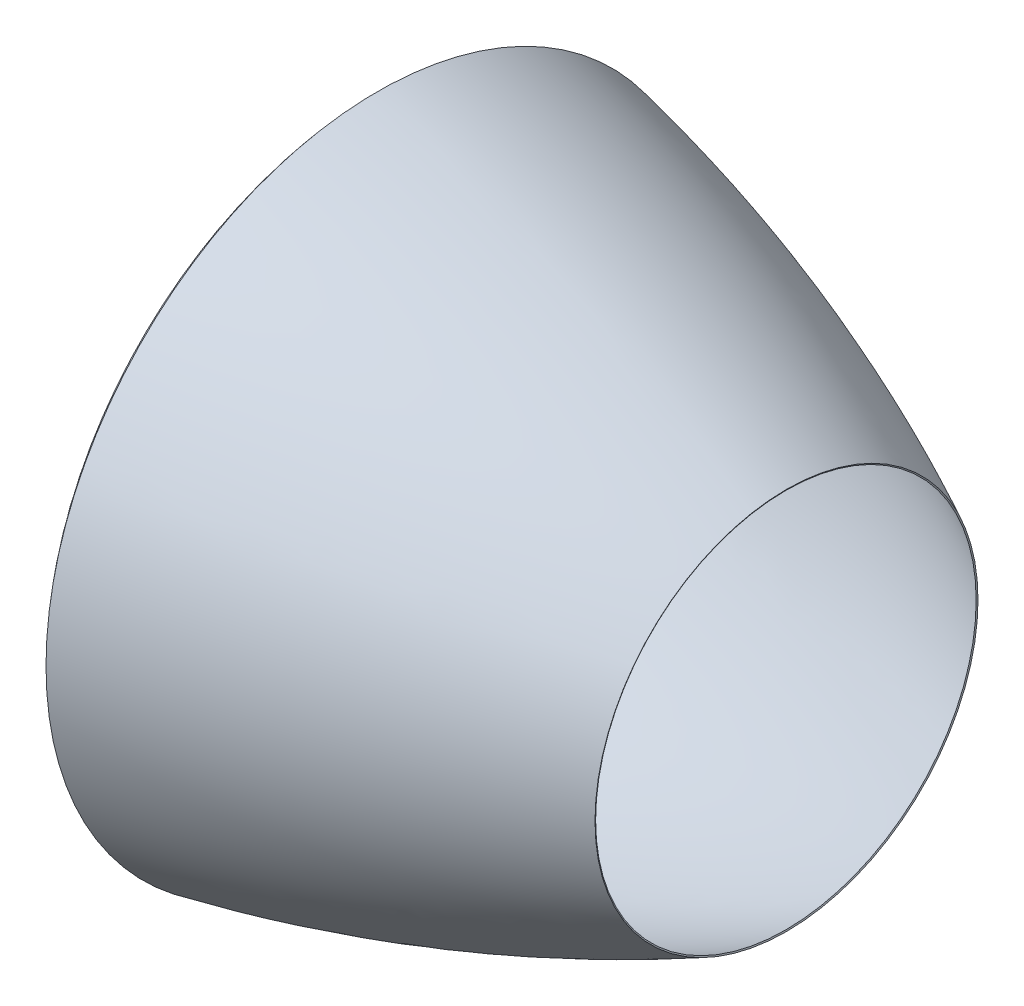
ISO-10303-21;
HEADER;
FILE_DESCRIPTION(('STEP AP214'),'2;1');
FILE_NAME('part.step','',(''),(''),'','','');
FILE_SCHEMA(('AUTOMOTIVE_DESIGN { 1 0 10303 214 1 1 1 1 }'));
ENDSEC;
DATA;
#1=APPLICATION_CONTEXT('core data for automotive mechanical design processes');
#2=APPLICATION_PROTOCOL_DEFINITION('international standard','automotive_design',2000,#1);
#3=PRODUCT_CONTEXT('',#1,'mechanical');
#4=PRODUCT('Part','Part','',(#3));
#5=PRODUCT_RELATED_PRODUCT_CATEGORY('part','',(#4));
#6=PRODUCT_DEFINITION_FORMATION('','',#4);
#7=PRODUCT_DEFINITION_CONTEXT('part definition',#1,'design');
#8=PRODUCT_DEFINITION('design','',#6,#7);
#9=PRODUCT_DEFINITION_SHAPE('','',#8);
#10=(LENGTH_UNIT() NAMED_UNIT(*) SI_UNIT(.MILLI.,.METRE.));
#11=(NAMED_UNIT(*) PLANE_ANGLE_UNIT() SI_UNIT($,.RADIAN.));
#12=(NAMED_UNIT(*) SI_UNIT($,.STERADIAN.) SOLID_ANGLE_UNIT());
#13=UNCERTAINTY_MEASURE_WITH_UNIT(LENGTH_MEASURE(1.E-05),#10,'distance_accuracy_value','');
#14=(GEOMETRIC_REPRESENTATION_CONTEXT(3) GLOBAL_UNCERTAINTY_ASSIGNED_CONTEXT((#13)) GLOBAL_UNIT_ASSIGNED_CONTEXT((#10,
#11,#12)) REPRESENTATION_CONTEXT('',''));
#15=CARTESIAN_POINT('',(0.,0.,0.));
#16=DIRECTION('',(0.,0.,1.));
#17=DIRECTION('',(1.,0.,0.));
#18=AXIS2_PLACEMENT_3D('',#15,#16,#17);
#19=CARTESIAN_POINT('',(130.,0.,0.));
#20=DIRECTION('',(-1.,0.,0.));
#21=DIRECTION('',(0.,0.,1.));
#22=AXIS2_PLACEMENT_3D('',#19,#20,#21);
#23=PLANE('',#22);
#24=CARTESIAN_POINT('',(130.,0.,0.));
#25=DIRECTION('',(1.,0.,0.));
#26=DIRECTION('',(0.,0.,-1.));
#27=AXIS2_PLACEMENT_3D('',#24,#25,#26);
#28=CIRCLE('',#27,1045.);
#29=CARTESIAN_POINT('',(130.,0.,-1045.));
#30=VERTEX_POINT('',#29);
#31=EDGE_CURVE('E51',#30,#30,#28,.T.);
#32=ORIENTED_EDGE('',*,*,#31,.F.);
#33=EDGE_LOOP('',(#32));
#34=FACE_BOUND('',#33,.T.);
#35=CARTESIAN_POINT('',(130.,0.,0.));
#36=DIRECTION('',(1.,0.,0.));
#37=DIRECTION('',(0.,0.,-1.));
#38=AXIS2_PLACEMENT_3D('',#35,#36,#37);
#39=CIRCLE('',#38,1050.);
#40=CARTESIAN_POINT('',(130.,0.,-1050.));
#41=VERTEX_POINT('',#40);
#42=EDGE_CURVE('E114',#41,#41,#39,.T.);
#43=ORIENTED_EDGE('',*,*,#42,.T.);
#44=EDGE_LOOP('',(#43));
#45=FACE_BOUND('',#44,.T.);
#46=ADVANCED_FACE('F33',(#34,#45),#23,.F.);
#47=CARTESIAN_POINT('',(1500.,0.,0.));
#48=DIRECTION('',(1.,0.,0.));
#49=DIRECTION('',(0.,0.,-1.));
#50=AXIS2_PLACEMENT_3D('',#47,#48,#49);
#51=CONICAL_SURFACE('',#50,700.,1.1072028320888);
#52=CARTESIAN_POINT('',(1502.23582596774,0.,0.));
#53=DIRECTION('',(1.,0.,0.));
#54=DIRECTION('',(0.,1.,0.));
#55=AXIS2_PLACEMENT_3D('',#52,#53,#54);
#56=CIRCLE('',#55,704.472256951693);
#57=CARTESIAN_POINT('',(1502.23582596774,704.472256951693,0.));
#58=VERTEX_POINT('',#57);
#59=EDGE_CURVE('E10',#58,#58,#56,.T.);
#60=ORIENTED_EDGE('',*,*,#59,.T.);
#61=EDGE_LOOP('',(#60));
#62=FACE_BOUND('',#61,.T.);
#63=CARTESIAN_POINT('',(1500.,0.,0.));
#64=DIRECTION('',(1.,0.,0.));
#65=DIRECTION('',(0.,0.,-1.));
#66=AXIS2_PLACEMENT_3D('',#63,#64,#65);
#67=CIRCLE('',#66,700.);
#68=CARTESIAN_POINT('',(1500.,0.,-700.));
#69=VERTEX_POINT('',#68);
#70=EDGE_CURVE('E36',#69,#69,#67,.T.);
#71=ORIENTED_EDGE('',*,*,#70,.F.);
#72=EDGE_LOOP('',(#71));
#73=FACE_BOUND('',#72,.T.);
#74=ADVANCED_FACE('F150',(#62,#73),#51,.F.);
#75=CARTESIAN_POINT('',(1500.,700.,0.));
#76=CARTESIAN_POINT('',(784.002803611187,1057.95016740064,0.));
#77=CARTESIAN_POINT('',(-7.84002803611187,1216.23876385131,0.));
#78=CARTESIAN_POINT('',(-15.6800560722237,1217.80597767756,0.));
#79=B_SPLINE_CURVE_WITH_KNOTS('',2,(#75,#76,#77,#78),.UNSPECIFIED.,.F.,.F.,(3,1,3),(0.,1.,1.01),.UNSPECIFIED.);
#80=CARTESIAN_POINT('',(0.,0.,0.));
#81=DIRECTION('',(1.,0.,0.));
#82=AXIS1_PLACEMENT('',#80,#81);
#83=SURFACE_OF_REVOLUTION('',#79,#82);
#84=OFFSET_SURFACE('',#83,-5.,.F.);
#85=CARTESIAN_POINT('',(-1.75549284538014,0.,0.));
#86=DIRECTION('',(1.,0.,0.));
#87=DIRECTION('',(0.,0.,-1.));
#88=AXIS2_PLACEMENT_3D('',#85,#86,#87);
#89=CIRCLE('',#88,1220.12139180994);
#90=CARTESIAN_POINT('',(-1.75549284538014,0.,-1220.12139180994));
#91=VERTEX_POINT('',#90);
#92=EDGE_CURVE('E40',#91,#91,#89,.T.);
#93=ORIENTED_EDGE('',*,*,#92,.T.);
#94=EDGE_LOOP('',(#93));
#95=FACE_BOUND('',#94,.T.);
#96=ORIENTED_EDGE('',*,*,#59,.F.);
#97=EDGE_LOOP('',(#96));
#98=FACE_BOUND('',#97,.T.);
#99=ADVANCED_FACE('F70',(#95,#98),#84,.F.);
#100=CARTESIAN_POINT('',(2.02332260637415,1216.8423421101,0.));
#101=CARTESIAN_POINT('',(1.01166130318708,1215.75694606758,0.));
#102=CARTESIAN_POINT('',(-101.166130318708,1106.13194577325,0.));
#103=CARTESIAN_POINT('',(1.01166130318708,998.938680542268,0.));
#104=CARTESIAN_POINT('',(2.02332260637415,997.877361084535,0.));
#105=B_SPLINE_CURVE_WITH_KNOTS('',2,(#100,#101,#102,#103,#104),.UNSPECIFIED.,.F.,.F.,(3,1,1,3),
(-0.01,0.,1.,1.01),.UNSPECIFIED.);
#106=CARTESIAN_POINT('',(0.,0.,0.));
#107=DIRECTION('',(1.,0.,0.));
#108=AXIS1_PLACEMENT('',#106,#107);
#109=SURFACE_OF_REVOLUTION('',#105,#108);
#110=OFFSET_SURFACE('',#109,-5.,.F.);
#111=CARTESIAN_POINT('',(-2.14156990627334,0.,0.));
#112=DIRECTION('',(1.,0.,0.));
#113=DIRECTION('',(0.,0.,-1.));
#114=AXIS2_PLACEMENT_3D('',#111,#112,#113);
#115=CIRCLE('',#114,995.);
#116=CARTESIAN_POINT('',(-2.14156990627334,0.,-995.));
#117=VERTEX_POINT('',#116);
#118=EDGE_CURVE('E45',#117,#117,#115,.T.);
#119=ORIENTED_EDGE('',*,*,#118,.T.);
#120=EDGE_LOOP('',(#119));
#121=FACE_BOUND('',#120,.T.);
#122=ORIENTED_EDGE('',*,*,#92,.F.);
#123=EDGE_LOOP('',(#122));
#124=FACE_BOUND('',#123,.T.);
#125=ADVANCED_FACE('F71',(#121,#124),#110,.F.);
#126=CARTESIAN_POINT('',(0.,0.,0.));
#127=DIRECTION('',(1.,0.,0.));
#128=DIRECTION('',(0.,0.,-1.));
#129=AXIS2_PLACEMENT_3D('',#126,#127,#128);
#130=CYLINDRICAL_SURFACE('',#129,995.);
#131=CARTESIAN_POINT('',(85.,0.,0.));
#132=DIRECTION('',(1.,0.,0.));
#133=DIRECTION('',(0.,0.,-1.));
#134=AXIS2_PLACEMENT_3D('',#131,#132,#133);
#135=CIRCLE('',#134,995.);
#136=CARTESIAN_POINT('',(85.,0.,-995.));
#137=VERTEX_POINT('',#136);
#138=EDGE_CURVE('E54',#137,#137,#135,.T.);
#139=ORIENTED_EDGE('',*,*,#138,.T.);
#140=EDGE_LOOP('',(#139));
#141=FACE_BOUND('',#140,.T.);
#142=ORIENTED_EDGE('',*,*,#118,.F.);
#143=EDGE_LOOP('',(#142));
#144=FACE_BOUND('',#143,.T.);
#145=ADVANCED_FACE('F74',(#141,#144),#130,.F.);
#146=CARTESIAN_POINT('',(85.,1000.,0.));
#147=DIRECTION('',(1.,0.,0.));
#148=DIRECTION('',(0.,0.,-1.));
#149=AXIS2_PLACEMENT_3D('',#146,#147,#148);
#150=PLANE('',#149);
#151=CARTESIAN_POINT('',(85.,0.,0.));
#152=DIRECTION('',(1.,0.,0.));
#153=DIRECTION('',(0.,0.,-1.));
#154=AXIS2_PLACEMENT_3D('',#151,#152,#153);
#155=CIRCLE('',#154,1045.);
#156=CARTESIAN_POINT('',(85.,0.,-1045.));
#157=VERTEX_POINT('',#156);
#158=EDGE_CURVE('E49',#157,#157,#155,.T.);
#159=ORIENTED_EDGE('',*,*,#158,.T.);
#160=EDGE_LOOP('',(#159));
#161=FACE_BOUND('',#160,.T.);
#162=ORIENTED_EDGE('',*,*,#138,.F.);
#163=EDGE_LOOP('',(#162));
#164=FACE_BOUND('',#163,.T.);
#165=ADVANCED_FACE('F80',(#161,#164),#150,.T.);
#166=CARTESIAN_POINT('',(0.,0.,0.));
#167=DIRECTION('',(1.,0.,0.));
#168=DIRECTION('',(0.,0.,-1.));
#169=AXIS2_PLACEMENT_3D('',#166,#167,#168);
#170=CYLINDRICAL_SURFACE('',#169,1045.);
#171=ORIENTED_EDGE('',*,*,#31,.T.);
#172=EDGE_LOOP('',(#171));
#173=FACE_BOUND('',#172,.T.);
#174=ORIENTED_EDGE('',*,*,#158,.F.);
#175=EDGE_LOOP('',(#174));
#176=FACE_BOUND('',#175,.T.);
#177=ADVANCED_FACE('F84',(#173,#176),#170,.F.);
#178=CARTESIAN_POINT('',(1500.,700.,0.));
#179=CARTESIAN_POINT('',(784.002803611187,1057.95016740064,0.));
#180=CARTESIAN_POINT('',(0.,1214.67155002507,0.));
#181=B_SPLINE_CURVE_WITH_KNOTS('',2,(#178,#179,#180),.UNSPECIFIED.,.F.,.F.,(3,3),(0.,1.),.UNSPECIFIED.);
#182=CARTESIAN_POINT('',(0.,0.,0.));
#183=DIRECTION('',(1.,0.,0.));
#184=AXIS1_PLACEMENT('',#182,#183);
#185=SURFACE_OF_REVOLUTION('',#181,#184);
#186=CARTESIAN_POINT('',(0.,0.,0.));
#187=DIRECTION('',(1.,0.,0.));
#188=DIRECTION('',(0.,0.,-1.));
#189=AXIS2_PLACEMENT_3D('',#186,#187,#188);
#190=CIRCLE('',#189,1214.67155002507);
#191=CARTESIAN_POINT('',(0.,0.,-1214.67155002507));
#192=VERTEX_POINT('',#191);
#193=EDGE_CURVE('E128',#192,#192,#190,.T.);
#194=ORIENTED_EDGE('',*,*,#193,.F.);
#195=EDGE_LOOP('',(#194));
#196=FACE_BOUND('',#195,.T.);
#197=ORIENTED_EDGE('',*,*,#70,.T.);
#198=EDGE_LOOP('',(#197));
#199=FACE_BOUND('',#198,.T.);
#200=ADVANCED_FACE('F88',(#196,#199),#185,.T.);
#201=CARTESIAN_POINT('',(0.,1214.67155002507,0.));
#202=CARTESIAN_POINT('',(-101.166130318708,1106.13194577325,0.));
#203=CARTESIAN_POINT('',(0.,1000.,0.));
#204=B_SPLINE_CURVE_WITH_KNOTS('',2,(#201,#202,#203),.UNSPECIFIED.,.F.,.F.,(3,3),(0.,1.),.UNSPECIFIED.);
#205=CARTESIAN_POINT('',(0.,0.,0.));
#206=DIRECTION('',(1.,0.,0.));
#207=AXIS1_PLACEMENT('',#205,#206);
#208=SURFACE_OF_REVOLUTION('',#204,#207);
#209=CARTESIAN_POINT('',(0.,0.,0.));
#210=DIRECTION('',(1.,0.,0.));
#211=DIRECTION('',(0.,0.,-1.));
#212=AXIS2_PLACEMENT_3D('',#209,#210,#211);
#213=CIRCLE('',#212,1000.);
#214=CARTESIAN_POINT('',(0.,0.,-1000.));
#215=VERTEX_POINT('',#214);
#216=EDGE_CURVE('E126',#215,#215,#213,.T.);
#217=ORIENTED_EDGE('',*,*,#216,.F.);
#218=EDGE_LOOP('',(#217));
#219=FACE_BOUND('',#218,.T.);
#220=ORIENTED_EDGE('',*,*,#193,.T.);
#221=EDGE_LOOP('',(#220));
#222=FACE_BOUND('',#221,.T.);
#223=ADVANCED_FACE('F101',(#219,#222),#208,.T.);
#224=CARTESIAN_POINT('',(0.,0.,0.));
#225=DIRECTION('',(1.,0.,0.));
#226=DIRECTION('',(0.,0.,-1.));
#227=AXIS2_PLACEMENT_3D('',#224,#225,#226);
#228=CYLINDRICAL_SURFACE('',#227,1000.);
#229=CARTESIAN_POINT('',(80.,0.,0.));
#230=DIRECTION('',(1.,0.,0.));
#231=DIRECTION('',(0.,0.,-1.));
#232=AXIS2_PLACEMENT_3D('',#229,#230,#231);
#233=CIRCLE('',#232,1000.);
#234=CARTESIAN_POINT('',(80.,0.,-1000.));
#235=VERTEX_POINT('',#234);
#236=EDGE_CURVE('E120',#235,#235,#233,.T.);
#237=ORIENTED_EDGE('',*,*,#236,.F.);
#238=EDGE_LOOP('',(#237));
#239=FACE_BOUND('',#238,.T.);
#240=ORIENTED_EDGE('',*,*,#216,.T.);
#241=EDGE_LOOP('',(#240));
#242=FACE_BOUND('',#241,.T.);
#243=ADVANCED_FACE('F97',(#239,#242),#228,.T.);
#244=CARTESIAN_POINT('',(80.,1000.,0.));
#245=DIRECTION('',(1.,0.,0.));
#246=DIRECTION('',(0.,0.,-1.));
#247=AXIS2_PLACEMENT_3D('',#244,#245,#246);
#248=PLANE('',#247);
#249=CARTESIAN_POINT('',(80.,0.,0.));
#250=DIRECTION('',(1.,0.,0.));
#251=DIRECTION('',(0.,0.,-1.));
#252=AXIS2_PLACEMENT_3D('',#249,#250,#251);
#253=CIRCLE('',#252,1050.);
#254=CARTESIAN_POINT('',(80.,0.,-1050.));
#255=VERTEX_POINT('',#254);
#256=EDGE_CURVE('E121',#255,#255,#253,.T.);
#257=ORIENTED_EDGE('',*,*,#256,.F.);
#258=EDGE_LOOP('',(#257));
#259=FACE_BOUND('',#258,.T.);
#260=ORIENTED_EDGE('',*,*,#236,.T.);
#261=EDGE_LOOP('',(#260));
#262=FACE_BOUND('',#261,.T.);
#263=ADVANCED_FACE('F93',(#259,#262),#248,.F.);
#264=CARTESIAN_POINT('',(0.,0.,0.));
#265=DIRECTION('',(1.,0.,0.));
#266=DIRECTION('',(0.,0.,-1.));
#267=AXIS2_PLACEMENT_3D('',#264,#265,#266);
#268=CYLINDRICAL_SURFACE('',#267,1050.);
#269=ORIENTED_EDGE('',*,*,#42,.F.);
#270=EDGE_LOOP('',(#269));
#271=FACE_BOUND('',#270,.T.);
#272=ORIENTED_EDGE('',*,*,#256,.T.);
#273=EDGE_LOOP('',(#272));
#274=FACE_BOUND('',#273,.T.);
#275=ADVANCED_FACE('F90',(#271,#274),#268,.T.);
#276=CLOSED_SHELL('',(#46,#74,#99,#125,#145,#165,#177,#200,#223,#243,#263,#275));
#277=MANIFOLD_SOLID_BREP('B2',#276);
#278=ADVANCED_BREP_SHAPE_REPRESENTATION('',(#18,#277),#14);
#279=SHAPE_DEFINITION_REPRESENTATION(#9,#278);
ENDSEC;
END-ISO-10303-21;
